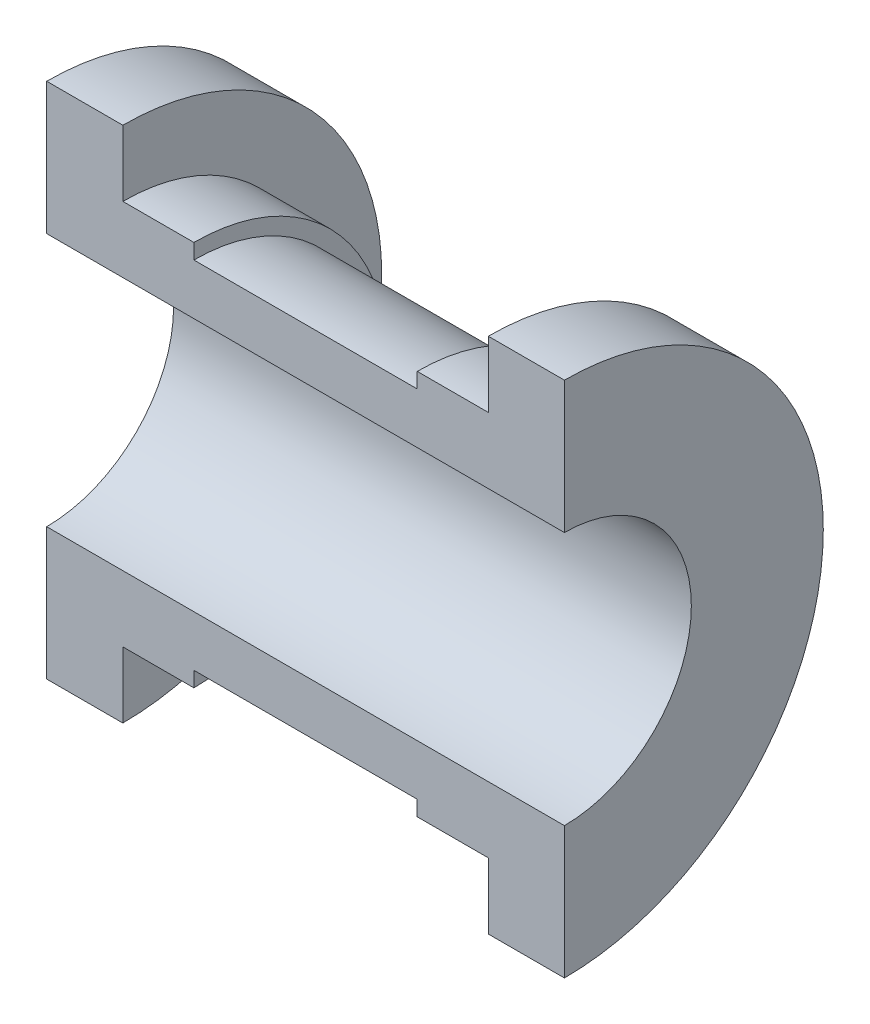
ISO-10303-21;
HEADER;
FILE_DESCRIPTION(('STEP AP214'),'2;1');
FILE_NAME('part.step','',(''),(''),'','','');
FILE_SCHEMA(('AUTOMOTIVE_DESIGN { 1 0 10303 214 1 1 1 1 }'));
ENDSEC;
DATA;
#1=APPLICATION_CONTEXT('core data for automotive mechanical design processes');
#2=APPLICATION_PROTOCOL_DEFINITION('international standard','automotive_design',2000,#1);
#3=PRODUCT_CONTEXT('',#1,'mechanical');
#4=PRODUCT('Part','Part','',(#3));
#5=PRODUCT_RELATED_PRODUCT_CATEGORY('part','',(#4));
#6=PRODUCT_DEFINITION_FORMATION('','',#4);
#7=PRODUCT_DEFINITION_CONTEXT('part definition',#1,'design');
#8=PRODUCT_DEFINITION('design','',#6,#7);
#9=PRODUCT_DEFINITION_SHAPE('','',#8);
#10=(LENGTH_UNIT() NAMED_UNIT(*) SI_UNIT(.MILLI.,.METRE.));
#11=(NAMED_UNIT(*) PLANE_ANGLE_UNIT() SI_UNIT($,.RADIAN.));
#12=(NAMED_UNIT(*) SI_UNIT($,.STERADIAN.) SOLID_ANGLE_UNIT());
#13=UNCERTAINTY_MEASURE_WITH_UNIT(LENGTH_MEASURE(1.E-05),#10,'distance_accuracy_value','');
#14=(GEOMETRIC_REPRESENTATION_CONTEXT(3) GLOBAL_UNCERTAINTY_ASSIGNED_CONTEXT((#13)) GLOBAL_UNIT_ASSIGNED_CONTEXT((#10,
#11,#12)) REPRESENTATION_CONTEXT('',''));
#15=CARTESIAN_POINT('',(0.,0.,0.));
#16=DIRECTION('',(0.,0.,1.));
#17=DIRECTION('',(1.,0.,0.));
#18=AXIS2_PLACEMENT_3D('',#15,#16,#17);
#19=CARTESIAN_POINT('',(0.,0.,-23.5));
#20=DIRECTION('',(0.,0.,1.));
#21=DIRECTION('',(1.,0.,0.));
#22=AXIS2_PLACEMENT_3D('',#19,#20,#21);
#23=CYLINDRICAL_SURFACE('',#22,3.);
#24=CARTESIAN_POINT('',(0.,0.,-23.5));
#25=DIRECTION('',(0.,0.,1.));
#26=DIRECTION('',(1.,0.,0.));
#27=AXIS2_PLACEMENT_3D('',#24,#25,#26);
#28=CIRCLE('',#27,3.);
#29=CARTESIAN_POINT('',(3.,0.,-23.5));
#30=VERTEX_POINT('',#29);
#31=EDGE_CURVE('E11',#30,#30,#28,.T.);
#32=ORIENTED_EDGE('',*,*,#31,.T.);
#33=EDGE_LOOP('',(#32));
#34=FACE_BOUND('',#33,.T.);
#35=CARTESIAN_POINT('',(0.,0.,-17.5));
#36=DIRECTION('',(0.,0.,1.));
#37=DIRECTION('',(1.,0.,0.));
#38=AXIS2_PLACEMENT_3D('',#35,#36,#37);
#39=CIRCLE('',#38,3.);
#40=CARTESIAN_POINT('',(3.,0.,-17.5));
#41=VERTEX_POINT('',#40);
#42=EDGE_CURVE('E44',#41,#41,#39,.T.);
#43=ORIENTED_EDGE('',*,*,#42,.F.);
#44=EDGE_LOOP('',(#43));
#45=FACE_BOUND('',#44,.T.);
#46=ADVANCED_FACE('F41',(#34,#45),#23,.T.);
#47=CARTESIAN_POINT('',(0.,0.,-23.5));
#48=DIRECTION('',(0.,0.,1.));
#49=DIRECTION('',(1.,0.,0.));
#50=AXIS2_PLACEMENT_3D('',#47,#48,#49);
#51=PLANE('',#50);
#52=ORIENTED_EDGE('',*,*,#31,.F.);
#53=EDGE_LOOP('',(#52));
#54=FACE_BOUND('',#53,.T.);
#55=ADVANCED_FACE('F56',(#54),#51,.F.);
#56=CARTESIAN_POINT('',(0.,0.,-17.5));
#57=DIRECTION('',(0.,0.,1.));
#58=DIRECTION('',(1.,0.,0.));
#59=AXIS2_PLACEMENT_3D('',#56,#57,#58);
#60=PLANE('',#59);
#61=ORIENTED_EDGE('',*,*,#42,.T.);
#62=EDGE_LOOP('',(#61));
#63=FACE_BOUND('',#62,.T.);
#64=ADVANCED_FACE('F53',(#63),#60,.T.);
#65=CLOSED_SHELL('',(#46,#55,#64));
#66=MANIFOLD_SOLID_BREP('B2',#65);
#67=CARTESIAN_POINT('',(0.,0.,0.));
#68=DIRECTION('',(0.,0.,1.));
#69=DIRECTION('',(-1.,0.,0.));
#70=AXIS2_PLACEMENT_3D('',#67,#68,#69);
#71=PLANE('',#70);
#72=DIRECTION('',(1.,0.,0.));
#73=VECTOR('',#72,1.);
#74=CARTESIAN_POINT('',(-25.5,-12.5,1.36167772214882E-13));
#75=LINE('',#74,#73);
#76=CARTESIAN_POINT('',(-25.5,-12.5,1.36167772214882E-13));
#77=VERTEX_POINT('',#76);
#78=CARTESIAN_POINT('',(25.5,-12.5,1.36167772214882E-13));
#79=VERTEX_POINT('',#78);
#80=EDGE_CURVE('E175',#77,#79,#75,.T.);
#81=ORIENTED_EDGE('',*,*,#80,.F.);
#82=DIRECTION('',(0.,1.,0.));
#83=VECTOR('',#82,1.);
#84=CARTESIAN_POINT('',(-25.5,0.,0.));
#85=LINE('',#84,#83);
#86=CARTESIAN_POINT('',(-25.5,-25.5,1.78065548281E-13));
#87=VERTEX_POINT('',#86);
#88=EDGE_CURVE('E179',#87,#77,#85,.T.);
#89=ORIENTED_EDGE('',*,*,#88,.F.);
#90=DIRECTION('',(-1.,0.,0.));
#91=VECTOR('',#90,1.);
#92=CARTESIAN_POINT('',(-25.5,-25.5,1.78065548281E-13));
#93=LINE('',#92,#91);
#94=CARTESIAN_POINT('',(-18.,-25.5,1.78065548281E-13));
#95=VERTEX_POINT('',#94);
#96=EDGE_CURVE('E186',#95,#87,#93,.T.);
#97=ORIENTED_EDGE('',*,*,#96,.F.);
#98=DIRECTION('',(0.,-1.,0.));
#99=VECTOR('',#98,1.);
#100=CARTESIAN_POINT('',(-18.,-25.5,1.78065548281E-13));
#101=LINE('',#100,#99);
#102=CARTESIAN_POINT('',(-18.,-19.,1.32676290876039E-13));
#103=VERTEX_POINT('',#102);
#104=EDGE_CURVE('E189',#103,#95,#101,.T.);
#105=ORIENTED_EDGE('',*,*,#104,.F.);
#106=DIRECTION('',(-1.,0.,0.));
#107=VECTOR('',#106,1.);
#108=CARTESIAN_POINT('',(-18.,-19.,1.32676290876039E-13));
#109=LINE('',#108,#107);
#110=CARTESIAN_POINT('',(-11.,-19.,1.32676290876039E-13));
#111=VERTEX_POINT('',#110);
#112=EDGE_CURVE('E246',#111,#103,#109,.T.);
#113=ORIENTED_EDGE('',*,*,#112,.F.);
#114=DIRECTION('',(0.,-1.,0.));
#115=VECTOR('',#114,1.);
#116=CARTESIAN_POINT('',(-11.,-19.,1.32676290876039E-13));
#117=LINE('',#116,#115);
#118=CARTESIAN_POINT('',(-11.,-17.5,1.2220184685951E-13));
#119=VERTEX_POINT('',#118);
#120=EDGE_CURVE('E243',#119,#111,#117,.T.);
#121=ORIENTED_EDGE('',*,*,#120,.F.);
#122=DIRECTION('',(-1.,0.,0.));
#123=VECTOR('',#122,1.);
#124=CARTESIAN_POINT('',(11.,-17.5,1.2220184685951E-13));
#125=LINE('',#124,#123);
#126=CARTESIAN_POINT('',(11.,-17.5,1.2220184685951E-13));
#127=VERTEX_POINT('',#126);
#128=EDGE_CURVE('E241',#127,#119,#125,.T.);
#129=ORIENTED_EDGE('',*,*,#128,.F.);
#130=DIRECTION('',(0.,1.,0.));
#131=VECTOR('',#130,1.);
#132=CARTESIAN_POINT('',(11.,-19.,1.32676290876039E-13));
#133=LINE('',#132,#131);
#134=CARTESIAN_POINT('',(11.,-19.,1.32676290876039E-13));
#135=VERTEX_POINT('',#134);
#136=EDGE_CURVE('E238',#135,#127,#133,.T.);
#137=ORIENTED_EDGE('',*,*,#136,.F.);
#138=DIRECTION('',(-1.,0.,0.));
#139=VECTOR('',#138,1.);
#140=CARTESIAN_POINT('',(18.,-19.,1.32676290876039E-13));
#141=LINE('',#140,#139);
#142=CARTESIAN_POINT('',(18.,-19.,1.32676290876039E-13));
#143=VERTEX_POINT('',#142);
#144=EDGE_CURVE('E235',#143,#135,#141,.T.);
#145=ORIENTED_EDGE('',*,*,#144,.F.);
#146=DIRECTION('',(0.,1.,0.));
#147=VECTOR('',#146,1.);
#148=CARTESIAN_POINT('',(18.,-25.5,1.78065548281E-13));
#149=LINE('',#148,#147);
#150=CARTESIAN_POINT('',(18.,-25.5,1.78065548281E-13));
#151=VERTEX_POINT('',#150);
#152=EDGE_CURVE('E232',#151,#143,#149,.T.);
#153=ORIENTED_EDGE('',*,*,#152,.F.);
#154=DIRECTION('',(-1.,0.,0.));
#155=VECTOR('',#154,1.);
#156=CARTESIAN_POINT('',(25.5,-25.5,1.78065548281E-13));
#157=LINE('',#156,#155);
#158=CARTESIAN_POINT('',(25.5,-25.5,1.78065548281E-13));
#159=VERTEX_POINT('',#158);
#160=EDGE_CURVE('E229',#159,#151,#157,.T.);
#161=ORIENTED_EDGE('',*,*,#160,.F.);
#162=DIRECTION('',(0.,-1.,0.));
#163=VECTOR('',#162,1.);
#164=CARTESIAN_POINT('',(25.5,0.,0.));
#165=LINE('',#164,#163);
#166=EDGE_CURVE('E223',#79,#159,#165,.T.);
#167=ORIENTED_EDGE('',*,*,#166,.F.);
#168=EDGE_LOOP('',(#81,#89,#97,#105,#113,#121,#129,#137,#145,#153,#161,#167));
#169=FACE_BOUND('',#168,.T.);
#170=ADVANCED_FACE('F82',(#169),#71,.T.);
#171=CARTESIAN_POINT('',(-25.5,0.,0.));
#172=DIRECTION('',(-1.,0.,0.));
#173=DIRECTION('',(0.,0.,1.));
#174=AXIS2_PLACEMENT_3D('',#171,#172,#173);
#175=PLANE('',#174);
#176=CARTESIAN_POINT('',(-25.5,0.,0.));
#177=DIRECTION('',(1.,0.,0.));
#178=DIRECTION('',(0.,0.,-1.));
#179=AXIS2_PLACEMENT_3D('',#176,#177,#178);
#180=CIRCLE('',#179,12.5);
#181=CARTESIAN_POINT('',(-25.5,12.5,0.));
#182=VERTEX_POINT('',#181);
#183=EDGE_CURVE('E170',#77,#182,#180,.T.);
#184=ORIENTED_EDGE('',*,*,#183,.T.);
#185=CARTESIAN_POINT('',(-25.5,25.5,0.));
#186=VERTEX_POINT('',#185);
#187=EDGE_CURVE('E177',#182,#186,#85,.T.);
#188=ORIENTED_EDGE('',*,*,#187,.T.);
#189=CARTESIAN_POINT('',(-25.5,0.,0.));
#190=DIRECTION('',(1.,0.,0.));
#191=DIRECTION('',(0.,0.,-1.));
#192=AXIS2_PLACEMENT_3D('',#189,#190,#191);
#193=CIRCLE('',#192,25.5);
#194=EDGE_CURVE('E39',#87,#186,#193,.T.);
#195=ORIENTED_EDGE('',*,*,#194,.F.);
#196=ORIENTED_EDGE('',*,*,#88,.T.);
#197=EDGE_LOOP('',(#184,#188,#195,#196));
#198=FACE_BOUND('',#197,.T.);
#199=ADVANCED_FACE('F84',(#198),#175,.T.);
#200=CARTESIAN_POINT('',(25.5,0.,0.));
#201=DIRECTION('',(1.,0.,0.));
#202=DIRECTION('',(0.,0.,-1.));
#203=AXIS2_PLACEMENT_3D('',#200,#201,#202);
#204=CYLINDRICAL_SURFACE('',#203,25.5);
#205=CARTESIAN_POINT('',(-18.,0.,0.));
#206=DIRECTION('',(1.,0.,0.));
#207=DIRECTION('',(0.,0.,-1.));
#208=AXIS2_PLACEMENT_3D('',#205,#206,#207);
#209=CIRCLE('',#208,25.5);
#210=CARTESIAN_POINT('',(-18.,25.5,0.));
#211=VERTEX_POINT('',#210);
#212=EDGE_CURVE('E90',#95,#211,#209,.T.);
#213=ORIENTED_EDGE('',*,*,#212,.F.);
#214=ORIENTED_EDGE('',*,*,#96,.T.);
#215=ORIENTED_EDGE('',*,*,#194,.T.);
#216=DIRECTION('',(-1.,0.,0.));
#217=VECTOR('',#216,1.);
#218=CARTESIAN_POINT('',(-25.5,25.5,0.));
#219=LINE('',#218,#217);
#220=EDGE_CURVE('E185',#211,#186,#219,.T.);
#221=ORIENTED_EDGE('',*,*,#220,.F.);
#222=EDGE_LOOP('',(#213,#214,#215,#221));
#223=FACE_BOUND('',#222,.T.);
#224=ADVANCED_FACE('F222',(#223),#204,.T.);
#225=CARTESIAN_POINT('',(-18.,-25.5,1.78065548281E-13));
#226=DIRECTION('',(1.,0.,0.));
#227=DIRECTION('',(0.,0.,-1.));
#228=AXIS2_PLACEMENT_3D('',#225,#226,#227);
#229=PLANE('',#228);
#230=CARTESIAN_POINT('',(-18.,0.,0.));
#231=DIRECTION('',(1.,0.,0.));
#232=DIRECTION('',(0.,0.,-1.));
#233=AXIS2_PLACEMENT_3D('',#230,#231,#232);
#234=CIRCLE('',#233,19.);
#235=CARTESIAN_POINT('',(-18.,19.,0.));
#236=VERTEX_POINT('',#235);
#237=EDGE_CURVE('E208',#103,#236,#234,.T.);
#238=ORIENTED_EDGE('',*,*,#237,.F.);
#239=ORIENTED_EDGE('',*,*,#104,.T.);
#240=ORIENTED_EDGE('',*,*,#212,.T.);
#241=DIRECTION('',(0.,1.,0.));
#242=VECTOR('',#241,1.);
#243=CARTESIAN_POINT('',(-18.,25.5,0.));
#244=LINE('',#243,#242);
#245=EDGE_CURVE('E213',#236,#211,#244,.T.);
#246=ORIENTED_EDGE('',*,*,#245,.F.);
#247=EDGE_LOOP('',(#238,#239,#240,#246));
#248=FACE_BOUND('',#247,.T.);
#249=ADVANCED_FACE('F212',(#248),#229,.T.);
#250=CARTESIAN_POINT('',(25.5,0.,0.));
#251=DIRECTION('',(1.,0.,0.));
#252=DIRECTION('',(0.,0.,-1.));
#253=AXIS2_PLACEMENT_3D('',#250,#251,#252);
#254=CYLINDRICAL_SURFACE('',#253,19.);
#255=CARTESIAN_POINT('',(-11.,0.,0.));
#256=DIRECTION('',(1.,0.,0.));
#257=DIRECTION('',(0.,0.,-1.));
#258=AXIS2_PLACEMENT_3D('',#255,#256,#257);
#259=CIRCLE('',#258,19.);
#260=CARTESIAN_POINT('',(-11.,19.,0.));
#261=VERTEX_POINT('',#260);
#262=EDGE_CURVE('E206',#111,#261,#259,.T.);
#263=ORIENTED_EDGE('',*,*,#262,.F.);
#264=ORIENTED_EDGE('',*,*,#112,.T.);
#265=ORIENTED_EDGE('',*,*,#237,.T.);
#266=DIRECTION('',(-1.,0.,0.));
#267=VECTOR('',#266,1.);
#268=CARTESIAN_POINT('',(-18.,19.,0.));
#269=LINE('',#268,#267);
#270=EDGE_CURVE('E220',#261,#236,#269,.T.);
#271=ORIENTED_EDGE('',*,*,#270,.F.);
#272=EDGE_LOOP('',(#263,#264,#265,#271));
#273=FACE_BOUND('',#272,.T.);
#274=ADVANCED_FACE('F250',(#273),#254,.T.);
#275=CARTESIAN_POINT('',(-11.,-19.,1.32676290876039E-13));
#276=DIRECTION('',(1.,0.,0.));
#277=DIRECTION('',(0.,0.,-1.));
#278=AXIS2_PLACEMENT_3D('',#275,#276,#277);
#279=PLANE('',#278);
#280=CARTESIAN_POINT('',(-11.,0.,0.));
#281=DIRECTION('',(1.,0.,0.));
#282=DIRECTION('',(0.,0.,-1.));
#283=AXIS2_PLACEMENT_3D('',#280,#281,#282);
#284=CIRCLE('',#283,17.5);
#285=CARTESIAN_POINT('',(-11.,17.5,0.));
#286=VERTEX_POINT('',#285);
#287=EDGE_CURVE('E203',#119,#286,#284,.T.);
#288=ORIENTED_EDGE('',*,*,#287,.F.);
#289=ORIENTED_EDGE('',*,*,#120,.T.);
#290=ORIENTED_EDGE('',*,*,#262,.T.);
#291=DIRECTION('',(0.,1.,0.));
#292=VECTOR('',#291,1.);
#293=CARTESIAN_POINT('',(-11.,19.,0.));
#294=LINE('',#293,#292);
#295=EDGE_CURVE('E272',#286,#261,#294,.T.);
#296=ORIENTED_EDGE('',*,*,#295,.F.);
#297=EDGE_LOOP('',(#288,#289,#290,#296));
#298=FACE_BOUND('',#297,.T.);
#299=ADVANCED_FACE('F277',(#298),#279,.T.);
#300=CARTESIAN_POINT('',(25.5,0.,0.));
#301=DIRECTION('',(1.,0.,0.));
#302=DIRECTION('',(0.,0.,-1.));
#303=AXIS2_PLACEMENT_3D('',#300,#301,#302);
#304=CYLINDRICAL_SURFACE('',#303,17.5);
#305=CARTESIAN_POINT('',(11.,0.,0.));
#306=DIRECTION('',(1.,0.,0.));
#307=DIRECTION('',(0.,0.,-1.));
#308=AXIS2_PLACEMENT_3D('',#305,#306,#307);
#309=CIRCLE('',#308,17.5);
#310=CARTESIAN_POINT('',(11.,17.5,0.));
#311=VERTEX_POINT('',#310);
#312=EDGE_CURVE('E201',#127,#311,#309,.T.);
#313=ORIENTED_EDGE('',*,*,#312,.F.);
#314=ORIENTED_EDGE('',*,*,#128,.T.);
#315=ORIENTED_EDGE('',*,*,#287,.T.);
#316=DIRECTION('',(-1.,0.,0.));
#317=VECTOR('',#316,1.);
#318=CARTESIAN_POINT('',(11.,17.5,0.));
#319=LINE('',#318,#317);
#320=EDGE_CURVE('E270',#311,#286,#319,.T.);
#321=ORIENTED_EDGE('',*,*,#320,.F.);
#322=EDGE_LOOP('',(#313,#314,#315,#321));
#323=FACE_BOUND('',#322,.T.);
#324=ADVANCED_FACE('F282',(#323),#304,.T.);
#325=CARTESIAN_POINT('',(11.,-19.,1.32676290876039E-13));
#326=DIRECTION('',(-1.,0.,0.));
#327=DIRECTION('',(0.,0.,1.));
#328=AXIS2_PLACEMENT_3D('',#325,#326,#327);
#329=PLANE('',#328);
#330=CARTESIAN_POINT('',(11.,0.,0.));
#331=DIRECTION('',(1.,0.,0.));
#332=DIRECTION('',(0.,0.,-1.));
#333=AXIS2_PLACEMENT_3D('',#330,#331,#332);
#334=CIRCLE('',#333,19.);
#335=CARTESIAN_POINT('',(11.,19.,0.));
#336=VERTEX_POINT('',#335);
#337=EDGE_CURVE('E199',#135,#336,#334,.T.);
#338=ORIENTED_EDGE('',*,*,#337,.F.);
#339=ORIENTED_EDGE('',*,*,#136,.T.);
#340=ORIENTED_EDGE('',*,*,#312,.T.);
#341=DIRECTION('',(0.,-1.,0.));
#342=VECTOR('',#341,1.);
#343=CARTESIAN_POINT('',(11.,19.,0.));
#344=LINE('',#343,#342);
#345=EDGE_CURVE('E267',#336,#311,#344,.T.);
#346=ORIENTED_EDGE('',*,*,#345,.F.);
#347=EDGE_LOOP('',(#338,#339,#340,#346));
#348=FACE_BOUND('',#347,.T.);
#349=ADVANCED_FACE('F285',(#348),#329,.T.);
#350=CARTESIAN_POINT('',(25.5,0.,0.));
#351=DIRECTION('',(1.,0.,0.));
#352=DIRECTION('',(0.,0.,-1.));
#353=AXIS2_PLACEMENT_3D('',#350,#351,#352);
#354=CYLINDRICAL_SURFACE('',#353,19.);
#355=CARTESIAN_POINT('',(18.,0.,0.));
#356=DIRECTION('',(1.,0.,0.));
#357=DIRECTION('',(0.,0.,-1.));
#358=AXIS2_PLACEMENT_3D('',#355,#356,#357);
#359=CIRCLE('',#358,19.);
#360=CARTESIAN_POINT('',(18.,19.,0.));
#361=VERTEX_POINT('',#360);
#362=EDGE_CURVE('E197',#143,#361,#359,.T.);
#363=ORIENTED_EDGE('',*,*,#362,.F.);
#364=ORIENTED_EDGE('',*,*,#144,.T.);
#365=ORIENTED_EDGE('',*,*,#337,.T.);
#366=DIRECTION('',(-1.,0.,0.));
#367=VECTOR('',#366,1.);
#368=CARTESIAN_POINT('',(18.,19.,0.));
#369=LINE('',#368,#367);
#370=EDGE_CURVE('E264',#361,#336,#369,.T.);
#371=ORIENTED_EDGE('',*,*,#370,.F.);
#372=EDGE_LOOP('',(#363,#364,#365,#371));
#373=FACE_BOUND('',#372,.T.);
#374=ADVANCED_FACE('F288',(#373),#354,.T.);
#375=CARTESIAN_POINT('',(18.,-25.5,1.78065548281E-13));
#376=DIRECTION('',(-1.,0.,0.));
#377=DIRECTION('',(0.,0.,1.));
#378=AXIS2_PLACEMENT_3D('',#375,#376,#377);
#379=PLANE('',#378);
#380=CARTESIAN_POINT('',(18.,0.,0.));
#381=DIRECTION('',(1.,0.,0.));
#382=DIRECTION('',(0.,0.,-1.));
#383=AXIS2_PLACEMENT_3D('',#380,#381,#382);
#384=CIRCLE('',#383,25.5);
#385=CARTESIAN_POINT('',(18.,25.5,0.));
#386=VERTEX_POINT('',#385);
#387=EDGE_CURVE('E195',#151,#386,#384,.T.);
#388=ORIENTED_EDGE('',*,*,#387,.F.);
#389=ORIENTED_EDGE('',*,*,#152,.T.);
#390=ORIENTED_EDGE('',*,*,#362,.T.);
#391=DIRECTION('',(0.,-1.,0.));
#392=VECTOR('',#391,1.);
#393=CARTESIAN_POINT('',(18.,25.5,0.));
#394=LINE('',#393,#392);
#395=EDGE_CURVE('E258',#386,#361,#394,.T.);
#396=ORIENTED_EDGE('',*,*,#395,.F.);
#397=EDGE_LOOP('',(#388,#389,#390,#396));
#398=FACE_BOUND('',#397,.T.);
#399=ADVANCED_FACE('F291',(#398),#379,.T.);
#400=CARTESIAN_POINT('',(25.5,0.,0.));
#401=DIRECTION('',(1.,0.,0.));
#402=DIRECTION('',(0.,0.,-1.));
#403=AXIS2_PLACEMENT_3D('',#400,#401,#402);
#404=CYLINDRICAL_SURFACE('',#403,25.5);
#405=CARTESIAN_POINT('',(25.5,0.,0.));
#406=DIRECTION('',(1.,0.,0.));
#407=DIRECTION('',(0.,0.,-1.));
#408=AXIS2_PLACEMENT_3D('',#405,#406,#407);
#409=CIRCLE('',#408,25.5);
#410=CARTESIAN_POINT('',(25.5,25.5,0.));
#411=VERTEX_POINT('',#410);
#412=EDGE_CURVE('E188',#159,#411,#409,.T.);
#413=ORIENTED_EDGE('',*,*,#412,.F.);
#414=ORIENTED_EDGE('',*,*,#160,.T.);
#415=ORIENTED_EDGE('',*,*,#387,.T.);
#416=DIRECTION('',(-1.,0.,0.));
#417=VECTOR('',#416,1.);
#418=CARTESIAN_POINT('',(25.5,25.5,0.));
#419=LINE('',#418,#417);
#420=EDGE_CURVE('E255',#411,#386,#419,.T.);
#421=ORIENTED_EDGE('',*,*,#420,.F.);
#422=EDGE_LOOP('',(#413,#414,#415,#421));
#423=FACE_BOUND('',#422,.T.);
#424=ADVANCED_FACE('F296',(#423),#404,.T.);
#425=CARTESIAN_POINT('',(25.5,0.,0.));
#426=DIRECTION('',(1.,0.,0.));
#427=DIRECTION('',(0.,0.,-1.));
#428=AXIS2_PLACEMENT_3D('',#425,#426,#427);
#429=PLANE('',#428);
#430=CARTESIAN_POINT('',(25.5,0.,0.));
#431=DIRECTION('',(1.,0.,0.));
#432=DIRECTION('',(0.,0.,-1.));
#433=AXIS2_PLACEMENT_3D('',#430,#431,#432);
#434=CIRCLE('',#433,12.5);
#435=CARTESIAN_POINT('',(25.5,12.5,0.));
#436=VERTEX_POINT('',#435);
#437=EDGE_CURVE('E97',#79,#436,#434,.T.);
#438=ORIENTED_EDGE('',*,*,#437,.F.);
#439=ORIENTED_EDGE('',*,*,#166,.T.);
#440=ORIENTED_EDGE('',*,*,#412,.T.);
#441=EDGE_CURVE('E225',#411,#436,#165,.T.);
#442=ORIENTED_EDGE('',*,*,#441,.T.);
#443=EDGE_LOOP('',(#438,#439,#440,#442));
#444=FACE_BOUND('',#443,.T.);
#445=ADVANCED_FACE('F298',(#444),#429,.T.);
#446=DIRECTION('',(1.,0.,0.));
#447=VECTOR('',#446,1.);
#448=CARTESIAN_POINT('',(-25.5,12.5,0.));
#449=LINE('',#448,#447);
#450=EDGE_CURVE('E167',#182,#436,#449,.T.);
#451=ORIENTED_EDGE('',*,*,#450,.T.);
#452=ORIENTED_EDGE('',*,*,#441,.F.);
#453=ORIENTED_EDGE('',*,*,#420,.T.);
#454=ORIENTED_EDGE('',*,*,#395,.T.);
#455=ORIENTED_EDGE('',*,*,#370,.T.);
#456=ORIENTED_EDGE('',*,*,#345,.T.);
#457=ORIENTED_EDGE('',*,*,#320,.T.);
#458=ORIENTED_EDGE('',*,*,#295,.T.);
#459=ORIENTED_EDGE('',*,*,#270,.T.);
#460=ORIENTED_EDGE('',*,*,#245,.T.);
#461=ORIENTED_EDGE('',*,*,#220,.T.);
#462=ORIENTED_EDGE('',*,*,#187,.F.);
#463=EDGE_LOOP('',(#451,#452,#453,#454,#455,#456,#457,#458,#459,#460,#461,#462));
#464=FACE_BOUND('',#463,.T.);
#465=ADVANCED_FACE('F182',(#464),#71,.T.);
#466=CARTESIAN_POINT('',(-25.5,0.,0.));
#467=DIRECTION('',(1.,0.,0.));
#468=DIRECTION('',(0.,0.,-1.));
#469=AXIS2_PLACEMENT_3D('',#466,#467,#468);
#470=CYLINDRICAL_SURFACE('',#469,12.5);
#471=ORIENTED_EDGE('',*,*,#437,.T.);
#472=ORIENTED_EDGE('',*,*,#450,.F.);
#473=ORIENTED_EDGE('',*,*,#183,.F.);
#474=ORIENTED_EDGE('',*,*,#80,.T.);
#475=EDGE_LOOP('',(#471,#472,#473,#474));
#476=FACE_BOUND('',#475,.T.);
#477=ADVANCED_FACE('F169',(#476),#470,.F.);
#478=CLOSED_SHELL('',(#170,#199,#224,#249,#274,#299,#324,#349,#374,#399,#424,#445,#465,#477));
#479=MANIFOLD_SOLID_BREP('B6',#478);
#480=ADVANCED_BREP_SHAPE_REPRESENTATION('',(#18,#66,#479),#14);
#481=SHAPE_DEFINITION_REPRESENTATION(#9,#480);
ENDSEC;
END-ISO-10303-21;
